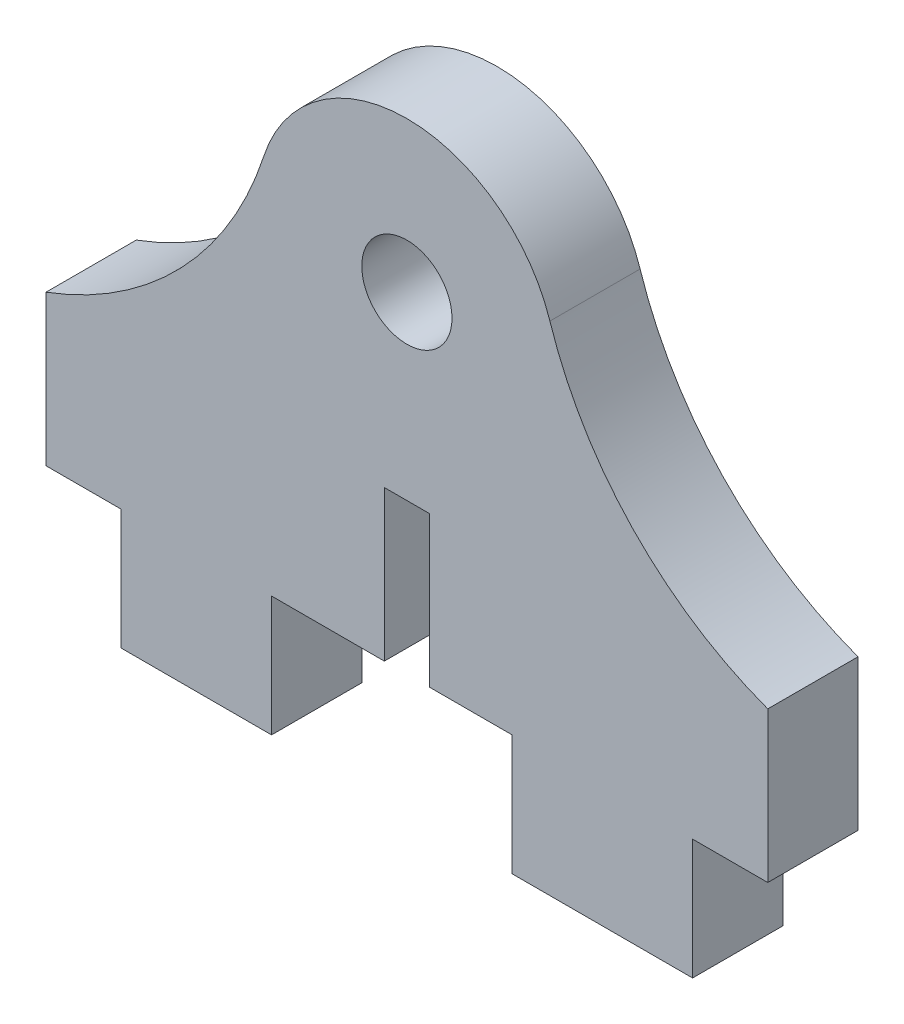
ISO-10303-21;
HEADER;
FILE_DESCRIPTION(('STEP AP214'),'2;1');
FILE_NAME('part.step','',(''),(''),'','','');
FILE_SCHEMA(('AUTOMOTIVE_DESIGN { 1 0 10303 214 1 1 1 1 }'));
ENDSEC;
DATA;
#1=APPLICATION_CONTEXT('core data for automotive mechanical design processes');
#2=APPLICATION_PROTOCOL_DEFINITION('international standard','automotive_design',2000,#1);
#3=PRODUCT_CONTEXT('',#1,'mechanical');
#4=PRODUCT('Part','Part','',(#3));
#5=PRODUCT_RELATED_PRODUCT_CATEGORY('part','',(#4));
#6=PRODUCT_DEFINITION_FORMATION('','',#4);
#7=PRODUCT_DEFINITION_CONTEXT('part definition',#1,'design');
#8=PRODUCT_DEFINITION('design','',#6,#7);
#9=PRODUCT_DEFINITION_SHAPE('','',#8);
#10=(LENGTH_UNIT() NAMED_UNIT(*) SI_UNIT(.MILLI.,.METRE.));
#11=(NAMED_UNIT(*) PLANE_ANGLE_UNIT() SI_UNIT($,.RADIAN.));
#12=(NAMED_UNIT(*) SI_UNIT($,.STERADIAN.) SOLID_ANGLE_UNIT());
#13=UNCERTAINTY_MEASURE_WITH_UNIT(LENGTH_MEASURE(1.E-05),#10,'distance_accuracy_value','');
#14=(GEOMETRIC_REPRESENTATION_CONTEXT(3) GLOBAL_UNCERTAINTY_ASSIGNED_CONTEXT((#13)) GLOBAL_UNIT_ASSIGNED_CONTEXT((#10,
#11,#12)) REPRESENTATION_CONTEXT('',''));
#15=CARTESIAN_POINT('',(0.,0.,0.));
#16=DIRECTION('',(0.,0.,1.));
#17=DIRECTION('',(1.,0.,0.));
#18=AXIS2_PLACEMENT_3D('',#15,#16,#17);
#19=CARTESIAN_POINT('',(1.25,-11.,3.));
#20=DIRECTION('',(0.,1.,0.));
#21=DIRECTION('',(0.,0.,1.));
#22=AXIS2_PLACEMENT_3D('',#19,#20,#21);
#23=PLANE('',#22);
#24=DIRECTION('',(1.,0.,0.));
#25=VECTOR('',#24,1.);
#26=CARTESIAN_POINT('',(1.25,-11.,3.));
#27=LINE('',#26,#25);
#28=CARTESIAN_POINT('',(0.75,-11.,3.));
#29=VERTEX_POINT('',#28);
#30=CARTESIAN_POINT('',(3.5,-11.,3.));
#31=VERTEX_POINT('',#30);
#32=EDGE_CURVE('E65',#29,#31,#27,.T.);
#33=ORIENTED_EDGE('',*,*,#32,.F.);
#34=DIRECTION('',(0.,0.,-1.));
#35=VECTOR('',#34,1.);
#36=CARTESIAN_POINT('',(0.75,-11.,3.));
#37=LINE('',#36,#35);
#38=CARTESIAN_POINT('',(0.75,-11.,0.));
#39=VERTEX_POINT('',#38);
#40=EDGE_CURVE('E11',#29,#39,#37,.T.);
#41=ORIENTED_EDGE('',*,*,#40,.T.);
#42=DIRECTION('',(1.,0.,0.));
#43=VECTOR('',#42,1.);
#44=CARTESIAN_POINT('',(1.25,-11.,0.));
#45=LINE('',#44,#43);
#46=CARTESIAN_POINT('',(3.5,-11.,0.));
#47=VERTEX_POINT('',#46);
#48=EDGE_CURVE('E333',#39,#47,#45,.T.);
#49=ORIENTED_EDGE('',*,*,#48,.T.);
#50=DIRECTION('',(0.,0.,1.));
#51=VECTOR('',#50,1.);
#52=CARTESIAN_POINT('',(3.5,-11.,-4.7169905660283));
#53=LINE('',#52,#51);
#54=EDGE_CURVE('E208',#47,#31,#53,.T.);
#55=ORIENTED_EDGE('',*,*,#54,.T.);
#56=EDGE_LOOP('',(#33,#41,#49,#55));
#57=FACE_BOUND('',#56,.T.);
#58=ADVANCED_FACE('F41',(#57),#23,.F.);
#59=CARTESIAN_POINT('',(9.5,-22.5,3.));
#60=DIRECTION('',(0.,0.,-1.));
#61=DIRECTION('',(-1.,0.,0.));
#62=AXIS2_PLACEMENT_3D('',#59,#60,#61);
#63=PLANE('',#62);
#64=DIRECTION('',(1.,0.,0.));
#65=VECTOR('',#64,1.);
#66=CARTESIAN_POINT('',(9.5,-6.,3.));
#67=LINE('',#66,#65);
#68=CARTESIAN_POINT('',(-0.75,-6.,3.));
#69=VERTEX_POINT('',#68);
#70=CARTESIAN_POINT('',(0.75,-6.,3.));
#71=VERTEX_POINT('',#70);
#72=EDGE_CURVE('E177',#69,#71,#67,.T.);
#73=ORIENTED_EDGE('',*,*,#72,.T.);
#74=DIRECTION('',(0.,-1.,0.));
#75=VECTOR('',#74,1.);
#76=CARTESIAN_POINT('',(0.750000000000001,-22.5,3.));
#77=LINE('',#76,#75);
#78=EDGE_CURVE('E200',#71,#29,#77,.T.);
#79=ORIENTED_EDGE('',*,*,#78,.T.);
#80=ORIENTED_EDGE('',*,*,#32,.T.);
#81=DIRECTION('',(0.,-1.,0.));
#82=VECTOR('',#81,1.);
#83=CARTESIAN_POINT('',(3.5,-15.,3.));
#84=LINE('',#83,#82);
#85=CARTESIAN_POINT('',(3.5,-15.,3.));
#86=VERTEX_POINT('',#85);
#87=EDGE_CURVE('E205',#31,#86,#84,.T.);
#88=ORIENTED_EDGE('',*,*,#87,.T.);
#89=DIRECTION('',(-1.,0.,0.));
#90=VECTOR('',#89,1.);
#91=CARTESIAN_POINT('',(-7.,-15.,3.));
#92=LINE('',#91,#90);
#93=CARTESIAN_POINT('',(9.5,-15.,3.));
#94=VERTEX_POINT('',#93);
#95=EDGE_CURVE('E274',#94,#86,#92,.T.);
#96=ORIENTED_EDGE('',*,*,#95,.F.);
#97=DIRECTION('',(0.,-1.,0.));
#98=VECTOR('',#97,1.);
#99=CARTESIAN_POINT('',(9.5,-15.,3.));
#100=LINE('',#99,#98);
#101=CARTESIAN_POINT('',(9.5,-11.,3.));
#102=VERTEX_POINT('',#101);
#103=EDGE_CURVE('E240',#102,#94,#100,.T.);
#104=ORIENTED_EDGE('',*,*,#103,.F.);
#105=DIRECTION('',(-1.,0.,0.));
#106=VECTOR('',#105,1.);
#107=CARTESIAN_POINT('',(9.5,-11.,3.));
#108=LINE('',#107,#106);
#109=CARTESIAN_POINT('',(12.,-11.,3.));
#110=VERTEX_POINT('',#109);
#111=EDGE_CURVE('E236',#110,#102,#108,.T.);
#112=ORIENTED_EDGE('',*,*,#111,.F.);
#113=DIRECTION('',(0.,1.,0.));
#114=VECTOR('',#113,1.);
#115=CARTESIAN_POINT('',(12.,-22.5,3.));
#116=LINE('',#115,#114);
#117=CARTESIAN_POINT('',(12.,-6.,3.));
#118=VERTEX_POINT('',#117);
#119=EDGE_CURVE('E289',#110,#118,#116,.T.);
#120=ORIENTED_EDGE('',*,*,#119,.T.);
#121=CARTESIAN_POINT('',(16.1680987660606,5.25286419878796,3.));
#122=DIRECTION('',(0.,0.,-1.));
#123=DIRECTION('',(-1.,0.,0.));
#124=AXIS2_PLACEMENT_3D('',#121,#122,#123);
#125=CIRCLE('',#124,12.);
#126=CARTESIAN_POINT('',(4.75532316648843,1.54496005846704,3.));
#127=VERTEX_POINT('',#126);
#128=EDGE_CURVE('E292',#118,#127,#125,.T.);
#129=ORIENTED_EDGE('',*,*,#128,.T.);
#130=CARTESIAN_POINT('',(0.,0.,3.));
#131=DIRECTION('',(0.,0.,1.));
#132=DIRECTION('',(1.,0.,0.));
#133=AXIS2_PLACEMENT_3D('',#130,#131,#132);
#134=CIRCLE('',#133,5.);
#135=CARTESIAN_POINT('',(-4.75532316648843,1.54496005846705,3.));
#136=VERTEX_POINT('',#135);
#137=EDGE_CURVE('E296',#127,#136,#134,.T.);
#138=ORIENTED_EDGE('',*,*,#137,.T.);
#139=CARTESIAN_POINT('',(-16.1680987660606,5.25286419878795,3.));
#140=DIRECTION('',(0.,0.,-1.));
#141=DIRECTION('',(1.,0.,0.));
#142=AXIS2_PLACEMENT_3D('',#139,#140,#141);
#143=CIRCLE('',#142,12.);
#144=CARTESIAN_POINT('',(-12.,-6.,3.));
#145=VERTEX_POINT('',#144);
#146=EDGE_CURVE('E299',#136,#145,#143,.T.);
#147=ORIENTED_EDGE('',*,*,#146,.T.);
#148=DIRECTION('',(0.,-1.,0.));
#149=VECTOR('',#148,1.);
#150=CARTESIAN_POINT('',(-12.,-11.,3.));
#151=LINE('',#150,#149);
#152=CARTESIAN_POINT('',(-12.,-11.,3.));
#153=VERTEX_POINT('',#152);
#154=EDGE_CURVE('E302',#145,#153,#151,.T.);
#155=ORIENTED_EDGE('',*,*,#154,.T.);
#156=DIRECTION('',(-1.,0.,0.));
#157=VECTOR('',#156,1.);
#158=CARTESIAN_POINT('',(-12.,-11.,3.));
#159=LINE('',#158,#157);
#160=CARTESIAN_POINT('',(-9.5,-11.,3.));
#161=VERTEX_POINT('',#160);
#162=EDGE_CURVE('E254',#161,#153,#159,.T.);
#163=ORIENTED_EDGE('',*,*,#162,.F.);
#164=DIRECTION('',(0.,1.,0.));
#165=VECTOR('',#164,1.);
#166=CARTESIAN_POINT('',(-9.5,-15.,3.));
#167=LINE('',#166,#165);
#168=CARTESIAN_POINT('',(-9.5,-15.,3.));
#169=VERTEX_POINT('',#168);
#170=EDGE_CURVE('E232',#169,#161,#167,.T.);
#171=ORIENTED_EDGE('',*,*,#170,.F.);
#172=DIRECTION('',(1.,0.,0.));
#173=VECTOR('',#172,1.);
#174=CARTESIAN_POINT('',(-12.,-15.,3.));
#175=LINE('',#174,#173);
#176=CARTESIAN_POINT('',(-4.5,-15.,3.));
#177=VERTEX_POINT('',#176);
#178=EDGE_CURVE('E306',#169,#177,#175,.T.);
#179=ORIENTED_EDGE('',*,*,#178,.T.);
#180=DIRECTION('',(0.,1.,0.));
#181=VECTOR('',#180,1.);
#182=CARTESIAN_POINT('',(-4.5,-11.,3.));
#183=LINE('',#182,#181);
#184=CARTESIAN_POINT('',(-4.5,-11.,3.));
#185=VERTEX_POINT('',#184);
#186=EDGE_CURVE('E217',#177,#185,#183,.T.);
#187=ORIENTED_EDGE('',*,*,#186,.T.);
#188=CARTESIAN_POINT('',(-0.75,-11.,3.));
#189=VERTEX_POINT('',#188);
#190=EDGE_CURVE('E309',#185,#189,#27,.T.);
#191=ORIENTED_EDGE('',*,*,#190,.T.);
#192=DIRECTION('',(0.,1.,0.));
#193=VECTOR('',#192,1.);
#194=CARTESIAN_POINT('',(-0.750000000000001,-22.5,3.));
#195=LINE('',#194,#193);
#196=EDGE_CURVE('E57',#189,#69,#195,.T.);
#197=ORIENTED_EDGE('',*,*,#196,.T.);
#198=EDGE_LOOP('',(#73,#79,#80,#88,#96,#104,#112,#120,#129,#138,#147,#155,#163,#171,#179,#187,
#191,#197));
#199=FACE_BOUND('',#198,.T.);
#200=CARTESIAN_POINT('',(0.,0.,3.));
#201=DIRECTION('',(0.,0.,1.));
#202=DIRECTION('',(1.,0.,0.));
#203=AXIS2_PLACEMENT_3D('',#200,#201,#202);
#204=CIRCLE('',#203,1.5);
#205=CARTESIAN_POINT('',(1.5,0.,3.));
#206=VERTEX_POINT('',#205);
#207=EDGE_CURVE('E281',#206,#206,#204,.T.);
#208=ORIENTED_EDGE('',*,*,#207,.F.);
#209=EDGE_LOOP('',(#208));
#210=FACE_BOUND('',#209,.T.);
#211=ADVANCED_FACE('F362',(#199,#210),#63,.F.);
#212=CARTESIAN_POINT('',(9.5,-22.5,0.));
#213=DIRECTION('',(0.,0.,-1.));
#214=DIRECTION('',(-1.,0.,0.));
#215=AXIS2_PLACEMENT_3D('',#212,#213,#214);
#216=PLANE('',#215);
#217=DIRECTION('',(0.,-1.,0.));
#218=VECTOR('',#217,1.);
#219=CARTESIAN_POINT('',(0.75,-16.,0.));
#220=LINE('',#219,#218);
#221=CARTESIAN_POINT('',(0.75,-6.,0.));
#222=VERTEX_POINT('',#221);
#223=EDGE_CURVE('E187',#222,#39,#220,.T.);
#224=ORIENTED_EDGE('',*,*,#223,.F.);
#225=DIRECTION('',(1.,0.,0.));
#226=VECTOR('',#225,1.);
#227=CARTESIAN_POINT('',(-0.75,-6.,0.));
#228=LINE('',#227,#226);
#229=CARTESIAN_POINT('',(-0.75,-6.,0.));
#230=VERTEX_POINT('',#229);
#231=EDGE_CURVE('E174',#230,#222,#228,.T.);
#232=ORIENTED_EDGE('',*,*,#231,.F.);
#233=DIRECTION('',(0.,1.,0.));
#234=VECTOR('',#233,1.);
#235=CARTESIAN_POINT('',(-0.75,-16.,0.));
#236=LINE('',#235,#234);
#237=CARTESIAN_POINT('',(-0.75,-11.,0.));
#238=VERTEX_POINT('',#237);
#239=EDGE_CURVE('E182',#238,#230,#236,.T.);
#240=ORIENTED_EDGE('',*,*,#239,.F.);
#241=CARTESIAN_POINT('',(-4.5,-11.,0.));
#242=VERTEX_POINT('',#241);
#243=EDGE_CURVE('E293',#242,#238,#45,.T.);
#244=ORIENTED_EDGE('',*,*,#243,.F.);
#245=DIRECTION('',(0.,1.,0.));
#246=VECTOR('',#245,1.);
#247=CARTESIAN_POINT('',(-4.5,-11.,0.));
#248=LINE('',#247,#246);
#249=CARTESIAN_POINT('',(-4.5,-15.,0.));
#250=VERTEX_POINT('',#249);
#251=EDGE_CURVE('E224',#250,#242,#248,.T.);
#252=ORIENTED_EDGE('',*,*,#251,.F.);
#253=DIRECTION('',(1.,0.,0.));
#254=VECTOR('',#253,1.);
#255=CARTESIAN_POINT('',(-12.,-15.,0.));
#256=LINE('',#255,#254);
#257=CARTESIAN_POINT('',(-9.5,-15.,0.));
#258=VERTEX_POINT('',#257);
#259=EDGE_CURVE('E330',#258,#250,#256,.T.);
#260=ORIENTED_EDGE('',*,*,#259,.F.);
#261=DIRECTION('',(0.,-1.,0.));
#262=VECTOR('',#261,1.);
#263=CARTESIAN_POINT('',(-9.5,-22.5,0.));
#264=LINE('',#263,#262);
#265=CARTESIAN_POINT('',(-9.5,-11.,0.));
#266=VERTEX_POINT('',#265);
#267=EDGE_CURVE('E265',#266,#258,#264,.T.);
#268=ORIENTED_EDGE('',*,*,#267,.F.);
#269=DIRECTION('',(1.,0.,0.));
#270=VECTOR('',#269,1.);
#271=CARTESIAN_POINT('',(9.5,-11.,0.));
#272=LINE('',#271,#270);
#273=CARTESIAN_POINT('',(-12.,-11.,0.));
#274=VERTEX_POINT('',#273);
#275=EDGE_CURVE('E268',#274,#266,#272,.T.);
#276=ORIENTED_EDGE('',*,*,#275,.F.);
#277=DIRECTION('',(0.,-1.,0.));
#278=VECTOR('',#277,1.);
#279=CARTESIAN_POINT('',(-12.,-11.,0.));
#280=LINE('',#279,#278);
#281=CARTESIAN_POINT('',(-12.,-6.,0.));
#282=VERTEX_POINT('',#281);
#283=EDGE_CURVE('E326',#282,#274,#280,.T.);
#284=ORIENTED_EDGE('',*,*,#283,.F.);
#285=CARTESIAN_POINT('',(-16.1680987660606,5.25286419878795,0.));
#286=DIRECTION('',(0.,0.,-1.));
#287=DIRECTION('',(1.,0.,0.));
#288=AXIS2_PLACEMENT_3D('',#285,#286,#287);
#289=CIRCLE('',#288,12.);
#290=CARTESIAN_POINT('',(-4.75532316648843,1.54496005846705,0.));
#291=VERTEX_POINT('',#290);
#292=EDGE_CURVE('E322',#291,#282,#289,.T.);
#293=ORIENTED_EDGE('',*,*,#292,.F.);
#294=CARTESIAN_POINT('',(0.,0.,0.));
#295=DIRECTION('',(0.,0.,1.));
#296=DIRECTION('',(1.,0.,0.));
#297=AXIS2_PLACEMENT_3D('',#294,#295,#296);
#298=CIRCLE('',#297,5.);
#299=CARTESIAN_POINT('',(4.75532316648843,1.54496005846704,0.));
#300=VERTEX_POINT('',#299);
#301=EDGE_CURVE('E319',#300,#291,#298,.T.);
#302=ORIENTED_EDGE('',*,*,#301,.F.);
#303=CARTESIAN_POINT('',(16.1680987660606,5.25286419878796,0.));
#304=DIRECTION('',(0.,0.,-1.));
#305=DIRECTION('',(-1.,0.,0.));
#306=AXIS2_PLACEMENT_3D('',#303,#304,#305);
#307=CIRCLE('',#306,12.);
#308=CARTESIAN_POINT('',(12.,-6.,0.));
#309=VERTEX_POINT('',#308);
#310=EDGE_CURVE('E316',#309,#300,#307,.T.);
#311=ORIENTED_EDGE('',*,*,#310,.F.);
#312=DIRECTION('',(0.,1.,0.));
#313=VECTOR('',#312,1.);
#314=CARTESIAN_POINT('',(12.,-22.5,0.));
#315=LINE('',#314,#313);
#316=CARTESIAN_POINT('',(12.,-11.,0.));
#317=VERTEX_POINT('',#316);
#318=EDGE_CURVE('E285',#317,#309,#315,.T.);
#319=ORIENTED_EDGE('',*,*,#318,.F.);
#320=DIRECTION('',(1.,0.,0.));
#321=VECTOR('',#320,1.);
#322=CARTESIAN_POINT('',(9.5,-11.,0.));
#323=LINE('',#322,#321);
#324=CARTESIAN_POINT('',(9.5,-11.,0.));
#325=VERTEX_POINT('',#324);
#326=EDGE_CURVE('E271',#325,#317,#323,.T.);
#327=ORIENTED_EDGE('',*,*,#326,.F.);
#328=DIRECTION('',(0.,1.,0.));
#329=VECTOR('',#328,1.);
#330=CARTESIAN_POINT('',(9.5,-22.5,0.));
#331=LINE('',#330,#329);
#332=CARTESIAN_POINT('',(9.5,-15.,0.));
#333=VERTEX_POINT('',#332);
#334=EDGE_CURVE('E248',#333,#325,#331,.T.);
#335=ORIENTED_EDGE('',*,*,#334,.F.);
#336=DIRECTION('',(-1.,0.,0.));
#337=VECTOR('',#336,1.);
#338=CARTESIAN_POINT('',(-7.,-15.,0.));
#339=LINE('',#338,#337);
#340=CARTESIAN_POINT('',(3.5,-15.,0.));
#341=VERTEX_POINT('',#340);
#342=EDGE_CURVE('E275',#333,#341,#339,.T.);
#343=ORIENTED_EDGE('',*,*,#342,.T.);
#344=DIRECTION('',(0.,-1.,0.));
#345=VECTOR('',#344,1.);
#346=CARTESIAN_POINT('',(3.5,-15.,0.));
#347=LINE('',#346,#345);
#348=EDGE_CURVE('E209',#47,#341,#347,.T.);
#349=ORIENTED_EDGE('',*,*,#348,.F.);
#350=ORIENTED_EDGE('',*,*,#48,.F.);
#351=EDGE_LOOP('',(#224,#232,#240,#244,#252,#260,#268,#276,#284,#293,#302,#311,#319,#327,#335,
#343,#349,#350));
#352=FACE_BOUND('',#351,.T.);
#353=CARTESIAN_POINT('',(0.,0.,0.));
#354=DIRECTION('',(0.,0.,1.));
#355=DIRECTION('',(1.,0.,0.));
#356=AXIS2_PLACEMENT_3D('',#353,#354,#355);
#357=CIRCLE('',#356,1.5);
#358=CARTESIAN_POINT('',(1.5,0.,0.));
#359=VERTEX_POINT('',#358);
#360=EDGE_CURVE('E278',#359,#359,#357,.T.);
#361=ORIENTED_EDGE('',*,*,#360,.T.);
#362=EDGE_LOOP('',(#361));
#363=FACE_BOUND('',#362,.T.);
#364=ADVANCED_FACE('F189',(#352,#363),#216,.T.);
#365=CARTESIAN_POINT('',(12.,-22.5,3.));
#366=DIRECTION('',(-1.,0.,0.));
#367=DIRECTION('',(0.,0.,1.));
#368=AXIS2_PLACEMENT_3D('',#365,#366,#367);
#369=PLANE('',#368);
#370=ORIENTED_EDGE('',*,*,#119,.F.);
#371=DIRECTION('',(0.,0.,1.));
#372=VECTOR('',#371,1.);
#373=CARTESIAN_POINT('',(12.,-11.,-7.));
#374=LINE('',#373,#372);
#375=EDGE_CURVE('E244',#317,#110,#374,.T.);
#376=ORIENTED_EDGE('',*,*,#375,.F.);
#377=ORIENTED_EDGE('',*,*,#318,.T.);
#378=DIRECTION('',(0.,0.,-1.));
#379=VECTOR('',#378,1.);
#380=CARTESIAN_POINT('',(12.,-6.,3.));
#381=LINE('',#380,#379);
#382=EDGE_CURVE('E347',#118,#309,#381,.T.);
#383=ORIENTED_EDGE('',*,*,#382,.F.);
#384=EDGE_LOOP('',(#370,#376,#377,#383));
#385=FACE_BOUND('',#384,.T.);
#386=ADVANCED_FACE('F43',(#385),#369,.F.);
#387=CARTESIAN_POINT('',(16.1680987660606,5.25286419878796,3.));
#388=DIRECTION('',(0.,0.,-1.));
#389=DIRECTION('',(-1.,0.,0.));
#390=AXIS2_PLACEMENT_3D('',#387,#388,#389);
#391=CYLINDRICAL_SURFACE('',#390,12.);
#392=ORIENTED_EDGE('',*,*,#310,.T.);
#393=DIRECTION('',(0.,0.,-1.));
#394=VECTOR('',#393,1.);
#395=CARTESIAN_POINT('',(4.75532316648843,1.54496005846704,3.));
#396=LINE('',#395,#394);
#397=EDGE_CURVE('E343',#127,#300,#396,.T.);
#398=ORIENTED_EDGE('',*,*,#397,.F.);
#399=ORIENTED_EDGE('',*,*,#128,.F.);
#400=ORIENTED_EDGE('',*,*,#382,.T.);
#401=EDGE_LOOP('',(#392,#398,#399,#400));
#402=FACE_BOUND('',#401,.T.);
#403=ADVANCED_FACE('F400',(#402),#391,.F.);
#404=CARTESIAN_POINT('',(0.,0.,3.));
#405=DIRECTION('',(0.,0.,-1.));
#406=DIRECTION('',(-1.,0.,0.));
#407=AXIS2_PLACEMENT_3D('',#404,#405,#406);
#408=CYLINDRICAL_SURFACE('',#407,5.);
#409=ORIENTED_EDGE('',*,*,#301,.T.);
#410=DIRECTION('',(0.,0.,-1.));
#411=VECTOR('',#410,1.);
#412=CARTESIAN_POINT('',(-4.75532316648843,1.54496005846705,3.));
#413=LINE('',#412,#411);
#414=EDGE_CURVE('E339',#136,#291,#413,.T.);
#415=ORIENTED_EDGE('',*,*,#414,.F.);
#416=ORIENTED_EDGE('',*,*,#137,.F.);
#417=ORIENTED_EDGE('',*,*,#397,.T.);
#418=EDGE_LOOP('',(#409,#415,#416,#417));
#419=FACE_BOUND('',#418,.T.);
#420=ADVANCED_FACE('F394',(#419),#408,.T.);
#421=CARTESIAN_POINT('',(-16.1680987660606,5.25286419878795,3.));
#422=DIRECTION('',(0.,0.,-1.));
#423=DIRECTION('',(-1.,0.,0.));
#424=AXIS2_PLACEMENT_3D('',#421,#422,#423);
#425=CYLINDRICAL_SURFACE('',#424,12.);
#426=ORIENTED_EDGE('',*,*,#292,.T.);
#427=DIRECTION('',(0.,0.,-1.));
#428=VECTOR('',#427,1.);
#429=CARTESIAN_POINT('',(-12.,-6.,3.));
#430=LINE('',#429,#428);
#431=EDGE_CURVE('E313',#145,#282,#430,.T.);
#432=ORIENTED_EDGE('',*,*,#431,.F.);
#433=ORIENTED_EDGE('',*,*,#146,.F.);
#434=ORIENTED_EDGE('',*,*,#414,.T.);
#435=EDGE_LOOP('',(#426,#432,#433,#434));
#436=FACE_BOUND('',#435,.T.);
#437=ADVANCED_FACE('F389',(#436),#425,.F.);
#438=CARTESIAN_POINT('',(-12.,-11.,3.));
#439=DIRECTION('',(1.,0.,0.));
#440=DIRECTION('',(0.,0.,-1.));
#441=AXIS2_PLACEMENT_3D('',#438,#439,#440);
#442=PLANE('',#441);
#443=ORIENTED_EDGE('',*,*,#283,.T.);
#444=DIRECTION('',(0.,0.,1.));
#445=VECTOR('',#444,1.);
#446=CARTESIAN_POINT('',(-12.,-11.,-7.));
#447=LINE('',#446,#445);
#448=EDGE_CURVE('E241',#274,#153,#447,.T.);
#449=ORIENTED_EDGE('',*,*,#448,.T.);
#450=ORIENTED_EDGE('',*,*,#154,.F.);
#451=ORIENTED_EDGE('',*,*,#431,.T.);
#452=EDGE_LOOP('',(#443,#449,#450,#451));
#453=FACE_BOUND('',#452,.T.);
#454=ADVANCED_FACE('F384',(#453),#442,.F.);
#455=CARTESIAN_POINT('',(-12.,-15.,3.));
#456=DIRECTION('',(0.,1.,0.));
#457=DIRECTION('',(0.,0.,1.));
#458=AXIS2_PLACEMENT_3D('',#455,#456,#457);
#459=PLANE('',#458);
#460=ORIENTED_EDGE('',*,*,#178,.F.);
#461=DIRECTION('',(0.,0.,-1.));
#462=VECTOR('',#461,1.);
#463=CARTESIAN_POINT('',(-9.5,-15.,3.));
#464=LINE('',#463,#462);
#465=EDGE_CURVE('E355',#169,#258,#464,.T.);
#466=ORIENTED_EDGE('',*,*,#465,.T.);
#467=ORIENTED_EDGE('',*,*,#259,.T.);
#468=DIRECTION('',(0.,0.,1.));
#469=VECTOR('',#468,1.);
#470=CARTESIAN_POINT('',(-4.5,-15.,-4.7169905660283));
#471=LINE('',#470,#469);
#472=EDGE_CURVE('E223',#250,#177,#471,.T.);
#473=ORIENTED_EDGE('',*,*,#472,.T.);
#474=EDGE_LOOP('',(#460,#466,#467,#473));
#475=FACE_BOUND('',#474,.T.);
#476=ADVANCED_FACE('F375',(#475),#459,.F.);
#477=ORIENTED_EDGE('',*,*,#243,.T.);
#478=DIRECTION('',(0.,0.,1.));
#479=VECTOR('',#478,1.);
#480=CARTESIAN_POINT('',(-0.75,-11.,3.));
#481=LINE('',#480,#479);
#482=EDGE_CURVE('E50',#238,#189,#481,.T.);
#483=ORIENTED_EDGE('',*,*,#482,.T.);
#484=ORIENTED_EDGE('',*,*,#190,.F.);
#485=DIRECTION('',(0.,0.,1.));
#486=VECTOR('',#485,1.);
#487=CARTESIAN_POINT('',(-4.5,-11.,-4.7169905660283));
#488=LINE('',#487,#486);
#489=EDGE_CURVE('E228',#242,#185,#488,.T.);
#490=ORIENTED_EDGE('',*,*,#489,.F.);
#491=EDGE_LOOP('',(#477,#483,#484,#490));
#492=FACE_BOUND('',#491,.T.);
#493=ADVANCED_FACE('F360',(#492),#23,.F.);
#494=CARTESIAN_POINT('',(0.,0.,3.));
#495=DIRECTION('',(0.,0.,-1.));
#496=DIRECTION('',(-1.,0.,0.));
#497=AXIS2_PLACEMENT_3D('',#494,#495,#496);
#498=CYLINDRICAL_SURFACE('',#497,1.5);
#499=ORIENTED_EDGE('',*,*,#207,.T.);
#500=EDGE_LOOP('',(#499));
#501=FACE_BOUND('',#500,.T.);
#502=ORIENTED_EDGE('',*,*,#360,.F.);
#503=EDGE_LOOP('',(#502));
#504=FACE_BOUND('',#503,.T.);
#505=ADVANCED_FACE('F449',(#501,#504),#498,.F.);
#506=CARTESIAN_POINT('',(-7.,-15.,0.));
#507=DIRECTION('',(0.,1.,0.));
#508=DIRECTION('',(0.,0.,1.));
#509=AXIS2_PLACEMENT_3D('',#506,#507,#508);
#510=PLANE('',#509);
#511=ORIENTED_EDGE('',*,*,#342,.F.);
#512=DIRECTION('',(0.,0.,1.));
#513=VECTOR('',#512,1.);
#514=CARTESIAN_POINT('',(9.5,-15.,0.));
#515=LINE('',#514,#513);
#516=EDGE_CURVE('E351',#333,#94,#515,.T.);
#517=ORIENTED_EDGE('',*,*,#516,.T.);
#518=ORIENTED_EDGE('',*,*,#95,.T.);
#519=DIRECTION('',(0.,0.,1.));
#520=VECTOR('',#519,1.);
#521=CARTESIAN_POINT('',(3.5,-15.,-4.7169905660283));
#522=LINE('',#521,#520);
#523=EDGE_CURVE('E213',#341,#86,#522,.T.);
#524=ORIENTED_EDGE('',*,*,#523,.F.);
#525=EDGE_LOOP('',(#511,#517,#518,#524));
#526=FACE_BOUND('',#525,.T.);
#527=ADVANCED_FACE('F417',(#526),#510,.F.);
#528=CARTESIAN_POINT('',(9.5,-15.,-7.));
#529=DIRECTION('',(-1.,0.,0.));
#530=DIRECTION('',(0.,0.,1.));
#531=AXIS2_PLACEMENT_3D('',#528,#529,#530);
#532=PLANE('',#531);
#533=ORIENTED_EDGE('',*,*,#334,.T.);
#534=DIRECTION('',(0.,0.,1.));
#535=VECTOR('',#534,1.);
#536=CARTESIAN_POINT('',(9.5,-11.,-7.));
#537=LINE('',#536,#535);
#538=EDGE_CURVE('E245',#325,#102,#537,.T.);
#539=ORIENTED_EDGE('',*,*,#538,.T.);
#540=ORIENTED_EDGE('',*,*,#103,.T.);
#541=ORIENTED_EDGE('',*,*,#516,.F.);
#542=EDGE_LOOP('',(#533,#539,#540,#541));
#543=FACE_BOUND('',#542,.T.);
#544=ADVANCED_FACE('F413',(#543),#532,.F.);
#545=CARTESIAN_POINT('',(9.5,-11.,-7.));
#546=DIRECTION('',(0.,1.,0.));
#547=DIRECTION('',(0.,0.,1.));
#548=AXIS2_PLACEMENT_3D('',#545,#546,#547);
#549=PLANE('',#548);
#550=ORIENTED_EDGE('',*,*,#326,.T.);
#551=ORIENTED_EDGE('',*,*,#375,.T.);
#552=ORIENTED_EDGE('',*,*,#111,.T.);
#553=ORIENTED_EDGE('',*,*,#538,.F.);
#554=EDGE_LOOP('',(#550,#551,#552,#553));
#555=FACE_BOUND('',#554,.T.);
#556=ADVANCED_FACE('F408',(#555),#549,.F.);
#557=CARTESIAN_POINT('',(-12.,-11.,-7.));
#558=DIRECTION('',(0.,1.,0.));
#559=DIRECTION('',(0.,0.,1.));
#560=AXIS2_PLACEMENT_3D('',#557,#558,#559);
#561=PLANE('',#560);
#562=ORIENTED_EDGE('',*,*,#275,.T.);
#563=DIRECTION('',(0.,0.,1.));
#564=VECTOR('',#563,1.);
#565=CARTESIAN_POINT('',(-9.5,-11.,-7.));
#566=LINE('',#565,#564);
#567=EDGE_CURVE('E257',#266,#161,#566,.T.);
#568=ORIENTED_EDGE('',*,*,#567,.T.);
#569=ORIENTED_EDGE('',*,*,#162,.T.);
#570=ORIENTED_EDGE('',*,*,#448,.F.);
#571=EDGE_LOOP('',(#562,#568,#569,#570));
#572=FACE_BOUND('',#571,.T.);
#573=ADVANCED_FACE('F382',(#572),#561,.F.);
#574=CARTESIAN_POINT('',(-9.5,-15.,-7.));
#575=DIRECTION('',(1.,0.,0.));
#576=DIRECTION('',(0.,0.,-1.));
#577=AXIS2_PLACEMENT_3D('',#574,#575,#576);
#578=PLANE('',#577);
#579=ORIENTED_EDGE('',*,*,#267,.T.);
#580=ORIENTED_EDGE('',*,*,#465,.F.);
#581=ORIENTED_EDGE('',*,*,#170,.T.);
#582=ORIENTED_EDGE('',*,*,#567,.F.);
#583=EDGE_LOOP('',(#579,#580,#581,#582));
#584=FACE_BOUND('',#583,.T.);
#585=ADVANCED_FACE('F377',(#584),#578,.F.);
#586=CARTESIAN_POINT('',(-4.5,-11.,-4.7169905660283));
#587=DIRECTION('',(1.,0.,0.));
#588=DIRECTION('',(0.,1.,0.));
#589=AXIS2_PLACEMENT_3D('',#586,#587,#588);
#590=PLANE('',#589);
#591=ORIENTED_EDGE('',*,*,#472,.F.);
#592=ORIENTED_EDGE('',*,*,#251,.T.);
#593=ORIENTED_EDGE('',*,*,#489,.T.);
#594=ORIENTED_EDGE('',*,*,#186,.F.);
#595=EDGE_LOOP('',(#591,#592,#593,#594));
#596=FACE_BOUND('',#595,.T.);
#597=ADVANCED_FACE('F369',(#596),#590,.T.);
#598=CARTESIAN_POINT('',(3.5,-15.,-4.7169905660283));
#599=DIRECTION('',(-1.,0.,0.));
#600=DIRECTION('',(0.,0.,1.));
#601=AXIS2_PLACEMENT_3D('',#598,#599,#600);
#602=PLANE('',#601);
#603=ORIENTED_EDGE('',*,*,#54,.F.);
#604=ORIENTED_EDGE('',*,*,#348,.T.);
#605=ORIENTED_EDGE('',*,*,#523,.T.);
#606=ORIENTED_EDGE('',*,*,#87,.F.);
#607=EDGE_LOOP('',(#603,#604,#605,#606));
#608=FACE_BOUND('',#607,.T.);
#609=ADVANCED_FACE('F423',(#608),#602,.T.);
#610=CARTESIAN_POINT('',(-0.75,-6.,5.));
#611=DIRECTION('',(0.,1.,0.));
#612=DIRECTION('',(0.,0.,1.));
#613=AXIS2_PLACEMENT_3D('',#610,#611,#612);
#614=PLANE('',#613);
#615=DIRECTION('',(0.,0.,-1.));
#616=VECTOR('',#615,1.);
#617=CARTESIAN_POINT('',(-0.75,-6.,5.));
#618=LINE('',#617,#616);
#619=EDGE_CURVE('E169',#69,#230,#618,.T.);
#620=ORIENTED_EDGE('',*,*,#619,.T.);
#621=ORIENTED_EDGE('',*,*,#231,.T.);
#622=DIRECTION('',(0.,0.,-1.));
#623=VECTOR('',#622,1.);
#624=CARTESIAN_POINT('',(0.75,-6.,5.));
#625=LINE('',#624,#623);
#626=EDGE_CURVE('E179',#71,#222,#625,.T.);
#627=ORIENTED_EDGE('',*,*,#626,.F.);
#628=ORIENTED_EDGE('',*,*,#72,.F.);
#629=EDGE_LOOP('',(#620,#621,#627,#628));
#630=FACE_BOUND('',#629,.T.);
#631=ADVANCED_FACE('F171',(#630),#614,.F.);
#632=CARTESIAN_POINT('',(0.75,-16.,5.));
#633=DIRECTION('',(1.,0.,0.));
#634=DIRECTION('',(0.,0.,-1.));
#635=AXIS2_PLACEMENT_3D('',#632,#633,#634);
#636=PLANE('',#635);
#637=ORIENTED_EDGE('',*,*,#626,.T.);
#638=ORIENTED_EDGE('',*,*,#223,.T.);
#639=ORIENTED_EDGE('',*,*,#40,.F.);
#640=ORIENTED_EDGE('',*,*,#78,.F.);
#641=EDGE_LOOP('',(#637,#638,#639,#640));
#642=FACE_BOUND('',#641,.T.);
#643=ADVANCED_FACE('F428',(#642),#636,.F.);
#644=CARTESIAN_POINT('',(-0.75,-16.,5.));
#645=DIRECTION('',(-1.,0.,0.));
#646=DIRECTION('',(0.,0.,1.));
#647=AXIS2_PLACEMENT_3D('',#644,#645,#646);
#648=PLANE('',#647);
#649=ORIENTED_EDGE('',*,*,#482,.F.);
#650=ORIENTED_EDGE('',*,*,#239,.T.);
#651=ORIENTED_EDGE('',*,*,#619,.F.);
#652=ORIENTED_EDGE('',*,*,#196,.F.);
#653=EDGE_LOOP('',(#649,#650,#651,#652));
#654=FACE_BOUND('',#653,.T.);
#655=ADVANCED_FACE('F183',(#654),#648,.F.);
#656=CLOSED_SHELL('',(#58,#211,#364,#386,#403,#420,#437,#454,#476,#493,#505,#527,#544,#556,#573,
#585,#597,#609,#631,#643,#655));
#657=MANIFOLD_SOLID_BREP('B2',#656);
#658=ADVANCED_BREP_SHAPE_REPRESENTATION('',(#18,#657),#14);
#659=SHAPE_DEFINITION_REPRESENTATION(#9,#658);
ENDSEC;
END-ISO-10303-21;
